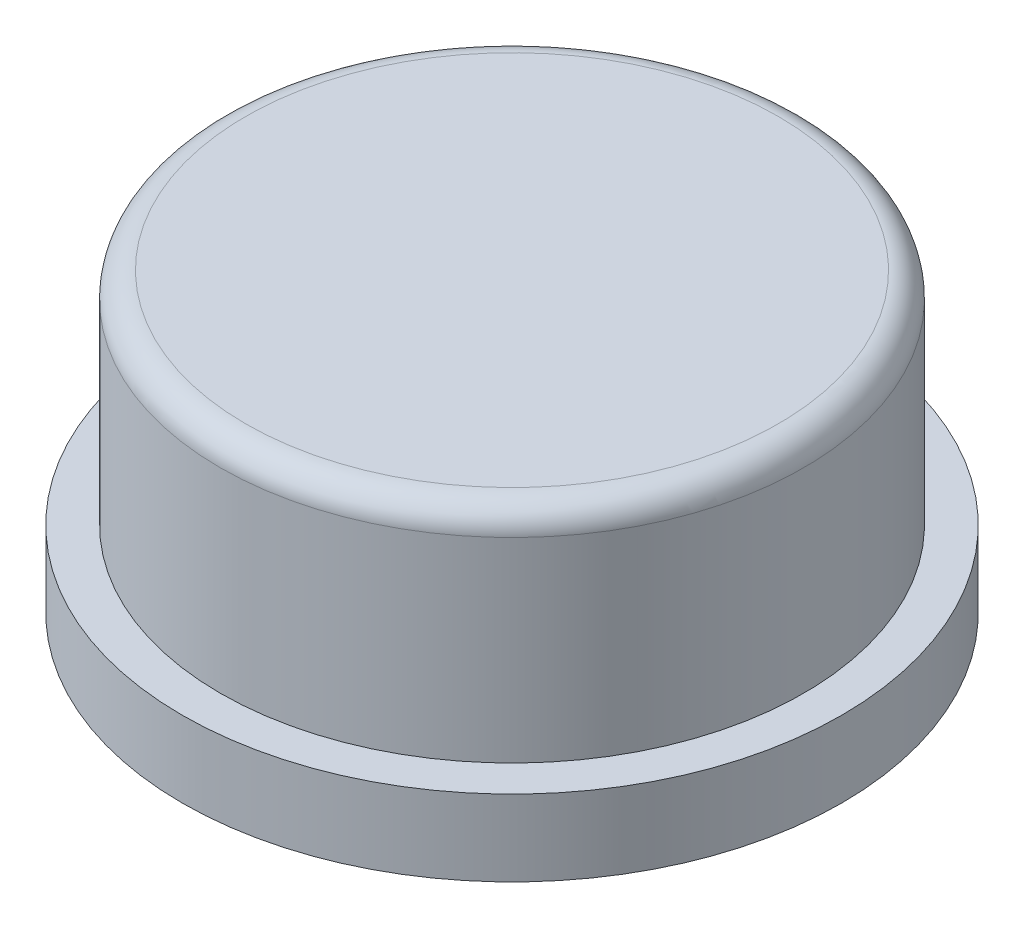
ISO-10303-21;
HEADER;
FILE_DESCRIPTION(('STEP AP214'),'2;1');
FILE_NAME('part.step','',(''),(''),'','','');
FILE_SCHEMA(('AUTOMOTIVE_DESIGN { 1 0 10303 214 1 1 1 1 }'));
ENDSEC;
DATA;
#1=APPLICATION_CONTEXT('core data for automotive mechanical design processes');
#2=APPLICATION_PROTOCOL_DEFINITION('international standard','automotive_design',2000,#1);
#3=PRODUCT_CONTEXT('',#1,'mechanical');
#4=PRODUCT('Part','Part','',(#3));
#5=PRODUCT_RELATED_PRODUCT_CATEGORY('part','',(#4));
#6=PRODUCT_DEFINITION_FORMATION('','',#4);
#7=PRODUCT_DEFINITION_CONTEXT('part definition',#1,'design');
#8=PRODUCT_DEFINITION('design','',#6,#7);
#9=PRODUCT_DEFINITION_SHAPE('','',#8);
#10=(LENGTH_UNIT() NAMED_UNIT(*) SI_UNIT(.MILLI.,.METRE.));
#11=(NAMED_UNIT(*) PLANE_ANGLE_UNIT() SI_UNIT($,.RADIAN.));
#12=(NAMED_UNIT(*) SI_UNIT($,.STERADIAN.) SOLID_ANGLE_UNIT());
#13=UNCERTAINTY_MEASURE_WITH_UNIT(LENGTH_MEASURE(1.E-05),#10,'distance_accuracy_value','');
#14=(GEOMETRIC_REPRESENTATION_CONTEXT(3) GLOBAL_UNCERTAINTY_ASSIGNED_CONTEXT((#13)) GLOBAL_UNIT_ASSIGNED_CONTEXT((#10,
#11,#12)) REPRESENTATION_CONTEXT('',''));
#15=CARTESIAN_POINT('',(0.,0.,0.));
#16=DIRECTION('',(0.,0.,1.));
#17=DIRECTION('',(1.,0.,0.));
#18=AXIS2_PLACEMENT_3D('',#15,#16,#17);
#19=CARTESIAN_POINT('',(0.,1.5,0.));
#20=DIRECTION('',(0.,-1.,0.));
#21=DIRECTION('',(0.,0.,-1.));
#22=AXIS2_PLACEMENT_3D('',#19,#20,#21);
#23=CYLINDRICAL_SURFACE('',#22,5.);
#24=CARTESIAN_POINT('',(0.,0.,0.));
#25=DIRECTION('',(0.,1.,0.));
#26=DIRECTION('',(0.,0.,1.));
#27=AXIS2_PLACEMENT_3D('',#24,#25,#26);
#28=CIRCLE('',#27,5.);
#29=CARTESIAN_POINT('',(0.,0.,5.));
#30=VERTEX_POINT('',#29);
#31=EDGE_CURVE('E60',#30,#30,#28,.T.);
#32=ORIENTED_EDGE('',*,*,#31,.F.);
#33=EDGE_LOOP('',(#32));
#34=FACE_BOUND('',#33,.T.);
#35=CARTESIAN_POINT('',(0.,1.85,0.));
#36=DIRECTION('',(0.,1.,0.));
#37=DIRECTION('',(0.,0.,1.));
#38=AXIS2_PLACEMENT_3D('',#35,#36,#37);
#39=CIRCLE('',#38,5.);
#40=CARTESIAN_POINT('',(0.,1.85,5.));
#41=VERTEX_POINT('',#40);
#42=EDGE_CURVE('E69',#41,#41,#39,.T.);
#43=ORIENTED_EDGE('',*,*,#42,.T.);
#44=EDGE_LOOP('',(#43));
#45=FACE_BOUND('',#44,.T.);
#46=ADVANCED_FACE('F37',(#34,#45),#23,.F.);
#47=CARTESIAN_POINT('',(0.,1.5,0.));
#48=DIRECTION('',(0.,1.,0.));
#49=DIRECTION('',(0.,0.,1.));
#50=AXIS2_PLACEMENT_3D('',#47,#48,#49);
#51=PLANE('',#50);
#52=CARTESIAN_POINT('',(0.,1.5,0.));
#53=DIRECTION('',(0.,1.,0.));
#54=DIRECTION('',(0.,0.,1.));
#55=AXIS2_PLACEMENT_3D('',#52,#53,#54);
#56=CIRCLE('',#55,6.5);
#57=CARTESIAN_POINT('',(0.,1.5,6.5));
#58=VERTEX_POINT('',#57);
#59=EDGE_CURVE('E50',#58,#58,#56,.T.);
#60=ORIENTED_EDGE('',*,*,#59,.T.);
#61=EDGE_LOOP('',(#60));
#62=FACE_BOUND('',#61,.T.);
#63=CARTESIAN_POINT('',(0.,1.5,0.));
#64=DIRECTION('',(0.,1.,0.));
#65=DIRECTION('',(0.,0.,1.));
#66=AXIS2_PLACEMENT_3D('',#63,#64,#65);
#67=CIRCLE('',#66,5.75);
#68=CARTESIAN_POINT('',(0.,1.5,5.75));
#69=VERTEX_POINT('',#68);
#70=EDGE_CURVE('E65',#69,#69,#67,.T.);
#71=ORIENTED_EDGE('',*,*,#70,.F.);
#72=EDGE_LOOP('',(#71));
#73=FACE_BOUND('',#72,.T.);
#74=ADVANCED_FACE('F85',(#62,#73),#51,.T.);
#75=CARTESIAN_POINT('',(0.,0.,0.));
#76=DIRECTION('',(0.,1.,0.));
#77=DIRECTION('',(0.,0.,1.));
#78=AXIS2_PLACEMENT_3D('',#75,#76,#77);
#79=PLANE('',#78);
#80=CARTESIAN_POINT('',(0.,0.,0.));
#81=DIRECTION('',(0.,1.,0.));
#82=DIRECTION('',(0.,0.,1.));
#83=AXIS2_PLACEMENT_3D('',#80,#81,#82);
#84=CIRCLE('',#83,6.5);
#85=CARTESIAN_POINT('',(0.,0.,6.5));
#86=VERTEX_POINT('',#85);
#87=EDGE_CURVE('E55',#86,#86,#84,.T.);
#88=ORIENTED_EDGE('',*,*,#87,.F.);
#89=EDGE_LOOP('',(#88));
#90=FACE_BOUND('',#89,.T.);
#91=ORIENTED_EDGE('',*,*,#31,.T.);
#92=EDGE_LOOP('',(#91));
#93=FACE_BOUND('',#92,.T.);
#94=ADVANCED_FACE('F91',(#90,#93),#79,.F.);
#95=CARTESIAN_POINT('',(0.,1.5,0.));
#96=DIRECTION('',(0.,-1.,0.));
#97=DIRECTION('',(0.,0.,-1.));
#98=AXIS2_PLACEMENT_3D('',#95,#96,#97);
#99=CYLINDRICAL_SURFACE('',#98,6.5);
#100=ORIENTED_EDGE('',*,*,#59,.F.);
#101=EDGE_LOOP('',(#100));
#102=FACE_BOUND('',#101,.T.);
#103=ORIENTED_EDGE('',*,*,#87,.T.);
#104=EDGE_LOOP('',(#103));
#105=FACE_BOUND('',#104,.T.);
#106=ADVANCED_FACE('F98',(#102,#105),#99,.T.);
#107=CARTESIAN_POINT('',(0.,5.85,0.));
#108=DIRECTION('',(0.,1.,0.));
#109=DIRECTION('',(0.,0.,1.));
#110=AXIS2_PLACEMENT_3D('',#107,#108,#109);
#111=PLANE('',#110);
#112=CARTESIAN_POINT('',(0.,5.85,0.));
#113=DIRECTION('',(0.,1.,0.));
#114=DIRECTION('',(0.,0.,1.));
#115=AXIS2_PLACEMENT_3D('',#112,#113,#114);
#116=CIRCLE('',#115,5.25);
#117=CARTESIAN_POINT('',(0.,5.85,5.25));
#118=VERTEX_POINT('',#117);
#119=EDGE_CURVE('E45',#118,#118,#116,.T.);
#120=ORIENTED_EDGE('',*,*,#119,.T.);
#121=EDGE_LOOP('',(#120));
#122=FACE_BOUND('',#121,.T.);
#123=ADVANCED_FACE('F101',(#122),#111,.T.);
#124=CARTESIAN_POINT('',(0.,5.85,0.));
#125=DIRECTION('',(0.,-1.,0.));
#126=DIRECTION('',(0.,0.,-1.));
#127=AXIS2_PLACEMENT_3D('',#124,#125,#126);
#128=CYLINDRICAL_SURFACE('',#127,5.75);
#129=CARTESIAN_POINT('',(0.,5.35,0.));
#130=DIRECTION('',(0.,1.,0.));
#131=DIRECTION('',(0.,0.,1.));
#132=AXIS2_PLACEMENT_3D('',#129,#130,#131);
#133=CIRCLE('',#132,5.75);
#134=CARTESIAN_POINT('',(0.,5.35,5.75));
#135=VERTEX_POINT('',#134);
#136=EDGE_CURVE('E10',#135,#135,#133,.F.);
#137=ORIENTED_EDGE('',*,*,#136,.T.);
#138=EDGE_LOOP('',(#137));
#139=FACE_BOUND('',#138,.T.);
#140=ORIENTED_EDGE('',*,*,#70,.T.);
#141=EDGE_LOOP('',(#140));
#142=FACE_BOUND('',#141,.T.);
#143=ADVANCED_FACE('F81',(#139,#142),#128,.T.);
#144=CARTESIAN_POINT('',(0.,5.35,0.));
#145=DIRECTION('',(0.,1.,0.));
#146=DIRECTION('',(0.,0.,1.));
#147=AXIS2_PLACEMENT_3D('',#144,#145,#146);
#148=TOROIDAL_SURFACE('',#147,5.25,0.5);
#149=ORIENTED_EDGE('',*,*,#136,.F.);
#150=EDGE_LOOP('',(#149));
#151=FACE_BOUND('',#150,.T.);
#152=ORIENTED_EDGE('',*,*,#119,.F.);
#153=EDGE_LOOP('',(#152));
#154=FACE_BOUND('',#153,.T.);
#155=ADVANCED_FACE('F39',(#151,#154),#148,.T.);
#156=CARTESIAN_POINT('',(0.,1.85,0.));
#157=DIRECTION('',(0.,1.,0.));
#158=DIRECTION('',(0.,0.,1.));
#159=AXIS2_PLACEMENT_3D('',#156,#157,#158);
#160=PLANE('',#159);
#161=ORIENTED_EDGE('',*,*,#42,.F.);
#162=EDGE_LOOP('',(#161));
#163=FACE_BOUND('',#162,.T.);
#164=ADVANCED_FACE('F75',(#163),#160,.F.);
#165=CLOSED_SHELL('',(#46,#74,#94,#106,#123,#143,#155,#164));
#166=MANIFOLD_SOLID_BREP('B2',#165);
#167=ADVANCED_BREP_SHAPE_REPRESENTATION('',(#18,#166),#14);
#168=SHAPE_DEFINITION_REPRESENTATION(#9,#167);
ENDSEC;
END-ISO-10303-21;
